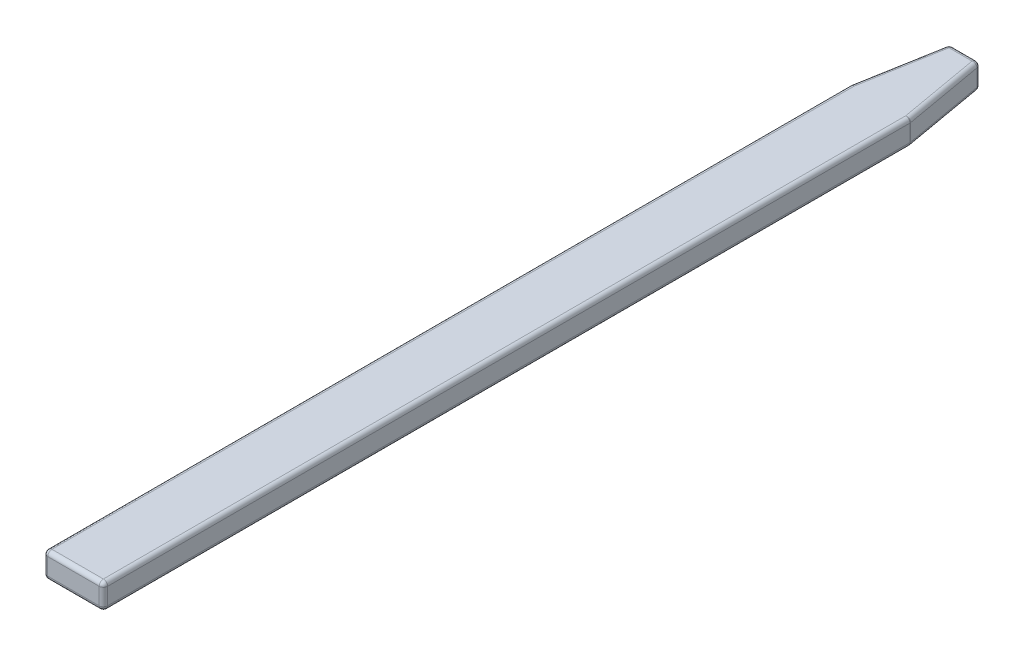
ISO-10303-21;
HEADER;
FILE_DESCRIPTION(('STEP AP214'),'2;1');
FILE_NAME('part.step','',(''),(''),'','','');
FILE_SCHEMA(('AUTOMOTIVE_DESIGN { 1 0 10303 214 1 1 1 1 }'));
ENDSEC;
DATA;
#1=APPLICATION_CONTEXT('core data for automotive mechanical design processes');
#2=APPLICATION_PROTOCOL_DEFINITION('international standard','automotive_design',2000,#1);
#3=PRODUCT_CONTEXT('',#1,'mechanical');
#4=PRODUCT('Part','Part','',(#3));
#5=PRODUCT_RELATED_PRODUCT_CATEGORY('part','',(#4));
#6=PRODUCT_DEFINITION_FORMATION('','',#4);
#7=PRODUCT_DEFINITION_CONTEXT('part definition',#1,'design');
#8=PRODUCT_DEFINITION('design','',#6,#7);
#9=PRODUCT_DEFINITION_SHAPE('','',#8);
#10=(LENGTH_UNIT() NAMED_UNIT(*) SI_UNIT(.MILLI.,.METRE.));
#11=(NAMED_UNIT(*) PLANE_ANGLE_UNIT() SI_UNIT($,.RADIAN.));
#12=(NAMED_UNIT(*) SI_UNIT($,.STERADIAN.) SOLID_ANGLE_UNIT());
#13=UNCERTAINTY_MEASURE_WITH_UNIT(LENGTH_MEASURE(1.E-05),#10,'distance_accuracy_value','');
#14=(GEOMETRIC_REPRESENTATION_CONTEXT(3) GLOBAL_UNCERTAINTY_ASSIGNED_CONTEXT((#13)) GLOBAL_UNIT_ASSIGNED_CONTEXT((#10,
#11,#12)) REPRESENTATION_CONTEXT('',''));
#15=CARTESIAN_POINT('',(0.,0.,0.));
#16=DIRECTION('',(0.,0.,1.));
#17=DIRECTION('',(1.,0.,0.));
#18=AXIS2_PLACEMENT_3D('',#15,#16,#17);
#19=CARTESIAN_POINT('',(-4.36328196226733,0.0999469366672908,-3.464));
#20=DIRECTION('',(0.351334189452752,-0.837407564963002,-0.418703782481497));
#21=DIRECTION('',(0.538275207015992,0.546578969722341,-0.641491411765704));
#22=AXIS2_PLACEMENT_3D('',#19,#20,#21);
#23=SPHERICAL_SURFACE('',#22,0.05);
#24=CARTESIAN_POINT('',(-4.36328196226733,0.0999469366672908,-3.464));
#25=DIRECTION('',(0.,1.,0.));
#26=DIRECTION('',(0.,0.,-1.));
#27=AXIS2_PLACEMENT_3D('',#24,#25,#26);
#28=CIRCLE('',#27,0.05);
#29=CARTESIAN_POINT('',(-4.31404157461672,0.0999469366672908,-3.47268240888335));
#30=VERTEX_POINT('',#29);
#31=CARTESIAN_POINT('',(-4.36328196226733,0.0999469366672908,-3.514));
#32=VERTEX_POINT('',#31);
#33=EDGE_CURVE('E11',#30,#32,#28,.T.);
#34=ORIENTED_EDGE('',*,*,#33,.T.);
#35=CARTESIAN_POINT('',(-4.36328196226733,0.0999469366672908,-3.464));
#36=DIRECTION('',(1.,0.,0.));
#37=DIRECTION('',(0.,1.,0.));
#38=AXIS2_PLACEMENT_3D('',#35,#36,#37);
#39=CIRCLE('',#38,0.05);
#40=CARTESIAN_POINT('',(-4.36328196226733,0.149946936667291,-3.464));
#41=VERTEX_POINT('',#40);
#42=EDGE_CURVE('E24',#32,#41,#39,.T.);
#43=ORIENTED_EDGE('',*,*,#42,.T.);
#44=CARTESIAN_POINT('',(-4.36328196226733,0.0999469366672908,-3.464));
#45=DIRECTION('',(-0.17364817766693,0.,-0.984807753012208));
#46=DIRECTION('',(0.984807753012208,0.,-0.17364817766693));
#47=AXIS2_PLACEMENT_3D('',#44,#45,#46);
#48=CIRCLE('',#47,0.0499999999999999);
#49=EDGE_CURVE('E280',#41,#30,#48,.T.);
#50=ORIENTED_EDGE('',*,*,#49,.T.);
#51=EDGE_LOOP('',(#34,#43,#50));
#52=FACE_BOUND('',#51,.T.);
#53=ADVANCED_FACE('F17',(#52),#23,.T.);
#54=CARTESIAN_POINT('',(-4.63671803773267,0.0999469366672909,-3.464));
#55=DIRECTION('',(-0.351334189452755,-0.837407564962995,-0.41870378248151));
#56=DIRECTION('',(-0.538275207015981,0.546578969722352,-0.641491411765703));
#57=AXIS2_PLACEMENT_3D('',#54,#55,#56);
#58=SPHERICAL_SURFACE('',#57,0.0499999999999994);
#59=CARTESIAN_POINT('',(-4.63671803773267,0.0999469366672909,-3.464));
#60=DIRECTION('',(-1.,0.,0.));
#61=DIRECTION('',(0.,0.,-1.));
#62=AXIS2_PLACEMENT_3D('',#59,#60,#61);
#63=CIRCLE('',#62,0.05);
#64=CARTESIAN_POINT('',(-4.63671803773267,0.149946936667291,-3.464));
#65=VERTEX_POINT('',#64);
#66=CARTESIAN_POINT('',(-4.63671803773267,0.0999469366672909,-3.514));
#67=VERTEX_POINT('',#66);
#68=EDGE_CURVE('E278',#65,#67,#63,.T.);
#69=ORIENTED_EDGE('',*,*,#68,.T.);
#70=CARTESIAN_POINT('',(-4.63671803773267,0.0999469366672909,-3.464));
#71=DIRECTION('',(0.,1.,0.));
#72=DIRECTION('',(-0.984807753012208,0.,-0.173648177666932));
#73=AXIS2_PLACEMENT_3D('',#70,#71,#72);
#74=CIRCLE('',#73,0.0499999999999994);
#75=CARTESIAN_POINT('',(-4.68595842538328,0.0999469366672909,-3.47268240888335));
#76=VERTEX_POINT('',#75);
#77=EDGE_CURVE('E276',#67,#76,#74,.T.);
#78=ORIENTED_EDGE('',*,*,#77,.T.);
#79=CARTESIAN_POINT('',(-4.63671803773267,0.0999469366672909,-3.464));
#80=DIRECTION('',(0.173648177666917,0.,-0.98480775301221));
#81=DIRECTION('',(0.,1.,0.));
#82=AXIS2_PLACEMENT_3D('',#79,#80,#81);
#83=CIRCLE('',#82,0.05);
#84=EDGE_CURVE('E273',#76,#65,#83,.T.);
#85=ORIENTED_EDGE('',*,*,#84,.T.);
#86=EDGE_LOOP('',(#69,#78,#85));
#87=FACE_BOUND('',#86,.T.);
#88=ADVANCED_FACE('F435',(#87),#58,.T.);
#89=CARTESIAN_POINT('',(-4.36328196226733,-0.100053063332709,-3.464));
#90=DIRECTION('',(-0.35133418945275,-0.837407564963,0.418703782481504));
#91=DIRECTION('',(0.538275207015991,-0.546578969722344,-0.641491411765702));
#92=AXIS2_PLACEMENT_3D('',#89,#90,#91);
#93=SPHERICAL_SURFACE('',#92,0.05);
#94=CARTESIAN_POINT('',(-4.36328196226733,-0.100053063332709,-3.464));
#95=DIRECTION('',(0.,-1.,0.));
#96=DIRECTION('',(0.984807753012208,0.,-0.17364817766693));
#97=AXIS2_PLACEMENT_3D('',#94,#95,#96);
#98=CIRCLE('',#97,0.0499999999999999);
#99=CARTESIAN_POINT('',(-4.36328196226733,-0.100053063332709,-3.514));
#100=VERTEX_POINT('',#99);
#101=CARTESIAN_POINT('',(-4.31404157461672,-0.100053063332709,-3.47268240888335));
#102=VERTEX_POINT('',#101);
#103=EDGE_CURVE('E271',#100,#102,#98,.T.);
#104=ORIENTED_EDGE('',*,*,#103,.T.);
#105=CARTESIAN_POINT('',(-4.36328196226733,-0.100053063332709,-3.464));
#106=DIRECTION('',(-0.173648177666943,0.,-0.984807753012206));
#107=DIRECTION('',(0.,-1.,0.));
#108=AXIS2_PLACEMENT_3D('',#105,#106,#107);
#109=CIRCLE('',#108,0.05);
#110=CARTESIAN_POINT('',(-4.36328196226733,-0.150053063332709,-3.464));
#111=VERTEX_POINT('',#110);
#112=EDGE_CURVE('E269',#102,#111,#109,.T.);
#113=ORIENTED_EDGE('',*,*,#112,.T.);
#114=CARTESIAN_POINT('',(-4.36328196226733,-0.100053063332709,-3.464));
#115=DIRECTION('',(1.,0.,0.));
#116=DIRECTION('',(0.,0.,-1.));
#117=AXIS2_PLACEMENT_3D('',#114,#115,#116);
#118=CIRCLE('',#117,0.05);
#119=EDGE_CURVE('E266',#111,#100,#118,.T.);
#120=ORIENTED_EDGE('',*,*,#119,.T.);
#121=EDGE_LOOP('',(#104,#113,#120));
#122=FACE_BOUND('',#121,.T.);
#123=ADVANCED_FACE('F432',(#122),#93,.T.);
#124=CARTESIAN_POINT('',(-4.195,0.0999469366672908,-2.50962556682371));
#125=DIRECTION('',(0.,0.,1.));
#126=DIRECTION('',(1.,0.,0.));
#127=AXIS2_PLACEMENT_3D('',#124,#125,#126);
#128=SPHERICAL_SURFACE('',#127,0.0499999999999999);
#129=CARTESIAN_POINT('',(-4.195,0.0999469366672908,-2.5096255668237));
#130=DIRECTION('',(0.,0.,-1.));
#131=DIRECTION('',(1.,0.,0.));
#132=AXIS2_PLACEMENT_3D('',#129,#130,#131);
#133=CIRCLE('',#132,0.05);
#134=CARTESIAN_POINT('',(-4.195,0.149946936667291,-2.50962556682371));
#135=VERTEX_POINT('',#134);
#136=CARTESIAN_POINT('',(-4.145,0.0999469366672909,-2.50962556682371));
#137=VERTEX_POINT('',#136);
#138=EDGE_CURVE('E264',#135,#137,#133,.T.);
#139=ORIENTED_EDGE('',*,*,#138,.T.);
#140=CARTESIAN_POINT('',(-4.195,0.0999469366672908,-2.50962556682371));
#141=DIRECTION('',(0.,1.,0.));
#142=DIRECTION('',(0.984807753012208,0.,-0.17364817766693));
#143=AXIS2_PLACEMENT_3D('',#140,#141,#142);
#144=CIRCLE('',#143,0.0499999999999999);
#145=CARTESIAN_POINT('',(-4.14575961234939,0.0999469366672908,-2.51830797570705));
#146=VERTEX_POINT('',#145);
#147=EDGE_CURVE('E262',#137,#146,#144,.T.);
#148=ORIENTED_EDGE('',*,*,#147,.T.);
#149=CARTESIAN_POINT('',(-4.195,0.0999469366672908,-2.50962556682371));
#150=DIRECTION('',(0.173648177666908,0.,0.984807753012212));
#151=DIRECTION('',(0.,1.,0.));
#152=AXIS2_PLACEMENT_3D('',#149,#150,#151);
#153=CIRCLE('',#152,0.05);
#154=EDGE_CURVE('E259',#146,#135,#153,.T.);
#155=ORIENTED_EDGE('',*,*,#154,.T.);
#156=EDGE_LOOP('',(#139,#148,#155));
#157=FACE_BOUND('',#156,.T.);
#158=ADVANCED_FACE('F434',(#157),#128,.T.);
#159=CARTESIAN_POINT('',(-4.63671803773267,-0.100053063332709,-3.464));
#160=DIRECTION('',(0.351334189452751,-0.837407564963003,0.418703782481496));
#161=DIRECTION('',(-0.538275207015993,-0.546578969722339,-0.641491411765704));
#162=AXIS2_PLACEMENT_3D('',#159,#160,#161);
#163=SPHERICAL_SURFACE('',#162,0.05);
#164=CARTESIAN_POINT('',(-4.63671803773267,-0.100053063332709,-3.464));
#165=DIRECTION('',(0.,-1.,0.));
#166=DIRECTION('',(0.,0.,-1.));
#167=AXIS2_PLACEMENT_3D('',#164,#165,#166);
#168=CIRCLE('',#167,0.05);
#169=CARTESIAN_POINT('',(-4.68595842538328,-0.100053063332709,-3.47268240888335));
#170=VERTEX_POINT('',#169);
#171=CARTESIAN_POINT('',(-4.63671803773267,-0.100053063332709,-3.514));
#172=VERTEX_POINT('',#171);
#173=EDGE_CURVE('E257',#170,#172,#168,.T.);
#174=ORIENTED_EDGE('',*,*,#173,.T.);
#175=CARTESIAN_POINT('',(-4.63671803773267,-0.100053063332709,-3.464));
#176=DIRECTION('',(-1.,0.,0.));
#177=DIRECTION('',(0.,-1.,0.));
#178=AXIS2_PLACEMENT_3D('',#175,#176,#177);
#179=CIRCLE('',#178,0.05);
#180=CARTESIAN_POINT('',(-4.63671803773267,-0.150053063332709,-3.464));
#181=VERTEX_POINT('',#180);
#182=EDGE_CURVE('E255',#172,#181,#179,.T.);
#183=ORIENTED_EDGE('',*,*,#182,.T.);
#184=CARTESIAN_POINT('',(-4.63671803773267,-0.100053063332709,-3.464));
#185=DIRECTION('',(0.173648177666928,0.,-0.984807753012208));
#186=DIRECTION('',(-0.984807753012208,0.,-0.173648177666928));
#187=AXIS2_PLACEMENT_3D('',#184,#185,#186);
#188=CIRCLE('',#187,0.0500000000000005);
#189=EDGE_CURVE('E252',#181,#170,#188,.T.);
#190=ORIENTED_EDGE('',*,*,#189,.T.);
#191=EDGE_LOOP('',(#174,#183,#190));
#192=FACE_BOUND('',#191,.T.);
#193=ADVANCED_FACE('F423',(#192),#163,.T.);
#194=CARTESIAN_POINT('',(-3.5525,-0.100053063332709,-3.464));
#195=DIRECTION('',(1.,0.,0.));
#196=DIRECTION('',(0.,-0.707106781186547,-0.707106781186548));
#197=AXIS2_PLACEMENT_3D('',#194,#195,#196);
#198=CYLINDRICAL_SURFACE('',#197,0.05);
#199=ORIENTED_EDGE('',*,*,#119,.F.);
#200=DIRECTION('',(-1.,0.,0.));
#201=VECTOR('',#200,1.);
#202=CARTESIAN_POINT('',(-3.5525,-0.150053063332709,-3.464));
#203=LINE('',#202,#201);
#204=EDGE_CURVE('E249',#111,#181,#203,.T.);
#205=ORIENTED_EDGE('',*,*,#204,.T.);
#206=ORIENTED_EDGE('',*,*,#182,.F.);
#207=DIRECTION('',(1.,0.,0.));
#208=VECTOR('',#207,1.);
#209=CARTESIAN_POINT('',(-3.5525,-0.100053063332709,-3.514));
#210=LINE('',#209,#208);
#211=EDGE_CURVE('E246',#172,#100,#210,.T.);
#212=ORIENTED_EDGE('',*,*,#211,.T.);
#213=EDGE_LOOP('',(#199,#205,#206,#212));
#214=FACE_BOUND('',#213,.T.);
#215=ADVANCED_FACE('F425',(#214),#198,.T.);
#216=CARTESIAN_POINT('',(-4.805,0.0999469366672909,-2.5096255668237));
#217=DIRECTION('',(0.,0.,1.));
#218=DIRECTION('',(1.,0.,0.));
#219=AXIS2_PLACEMENT_3D('',#216,#217,#218);
#220=SPHERICAL_SURFACE('',#219,0.05);
#221=CARTESIAN_POINT('',(-4.805,0.0999469366672909,-2.50962556682371));
#222=DIRECTION('',(0.,1.,0.));
#223=DIRECTION('',(-1.,0.,0.));
#224=AXIS2_PLACEMENT_3D('',#221,#222,#223);
#225=CIRCLE('',#224,0.05);
#226=CARTESIAN_POINT('',(-4.85424038765061,0.0999469366672909,-2.51830797570705));
#227=VERTEX_POINT('',#226);
#228=CARTESIAN_POINT('',(-4.855,0.099946936667291,-2.50962556682371));
#229=VERTEX_POINT('',#228);
#230=EDGE_CURVE('E244',#227,#229,#225,.T.);
#231=ORIENTED_EDGE('',*,*,#230,.T.);
#232=CARTESIAN_POINT('',(-4.805,0.0999469366672909,-2.5096255668237));
#233=DIRECTION('',(0.,0.,-1.));
#234=DIRECTION('',(0.,1.,0.));
#235=AXIS2_PLACEMENT_3D('',#232,#233,#234);
#236=CIRCLE('',#235,0.05);
#237=CARTESIAN_POINT('',(-4.805,0.149946936667291,-2.5096255668237));
#238=VERTEX_POINT('',#237);
#239=EDGE_CURVE('E242',#229,#238,#236,.T.);
#240=ORIENTED_EDGE('',*,*,#239,.T.);
#241=CARTESIAN_POINT('',(-4.805,0.0999469366672909,-2.5096255668237));
#242=DIRECTION('',(-0.173648177666939,0.,0.984807753012207));
#243=DIRECTION('',(-0.984807753012207,0.,-0.173648177666939));
#244=AXIS2_PLACEMENT_3D('',#241,#242,#243);
#245=CIRCLE('',#244,0.0500000000000006);
#246=EDGE_CURVE('E239',#238,#227,#245,.T.);
#247=ORIENTED_EDGE('',*,*,#246,.T.);
#248=EDGE_LOOP('',(#231,#240,#247));
#249=FACE_BOUND('',#248,.T.);
#250=ADVANCED_FACE('F415',(#249),#220,.T.);
#251=CARTESIAN_POINT('',(-4.195,-0.100053063332709,-2.5096255668237));
#252=DIRECTION('',(0.,0.,1.));
#253=DIRECTION('',(1.,0.,0.));
#254=AXIS2_PLACEMENT_3D('',#251,#252,#253);
#255=SPHERICAL_SURFACE('',#254,0.05);
#256=CARTESIAN_POINT('',(-4.195,-0.100053063332709,-2.5096255668237));
#257=DIRECTION('',(0.,-1.,0.));
#258=DIRECTION('',(1.,0.,0.));
#259=AXIS2_PLACEMENT_3D('',#256,#257,#258);
#260=CIRCLE('',#259,0.05);
#261=CARTESIAN_POINT('',(-4.14575961234939,-0.100053063332709,-2.51830797570705));
#262=VERTEX_POINT('',#261);
#263=CARTESIAN_POINT('',(-4.145,-0.100053063332709,-2.5096255668237));
#264=VERTEX_POINT('',#263);
#265=EDGE_CURVE('E237',#262,#264,#260,.T.);
#266=ORIENTED_EDGE('',*,*,#265,.T.);
#267=CARTESIAN_POINT('',(-4.195,-0.100053063332709,-2.5096255668237));
#268=DIRECTION('',(0.,0.,-1.));
#269=DIRECTION('',(0.,-1.,0.));
#270=AXIS2_PLACEMENT_3D('',#267,#268,#269);
#271=CIRCLE('',#270,0.05);
#272=CARTESIAN_POINT('',(-4.195,-0.150053063332709,-2.5096255668237));
#273=VERTEX_POINT('',#272);
#274=EDGE_CURVE('E235',#264,#273,#271,.T.);
#275=ORIENTED_EDGE('',*,*,#274,.T.);
#276=CARTESIAN_POINT('',(-4.195,-0.100053063332709,-2.5096255668237));
#277=DIRECTION('',(0.173648177666941,0.,0.984807753012206));
#278=DIRECTION('',(0.984807753012206,0.,-0.173648177666941));
#279=AXIS2_PLACEMENT_3D('',#276,#277,#278);
#280=CIRCLE('',#279,0.05);
#281=EDGE_CURVE('E232',#273,#262,#280,.T.);
#282=ORIENTED_EDGE('',*,*,#281,.T.);
#283=EDGE_LOOP('',(#266,#275,#282));
#284=FACE_BOUND('',#283,.T.);
#285=ADVANCED_FACE('F492',(#284),#255,.T.);
#286=CARTESIAN_POINT('',(-4.195,0.0999469366672908,7.006));
#287=DIRECTION('',(-0.816496580927725,0.408248290463866,0.408248290463862));
#288=DIRECTION('',(0.577350269189627,0.577350269189627,0.577350269189624));
#289=AXIS2_PLACEMENT_3D('',#286,#287,#288);
#290=SPHERICAL_SURFACE('',#289,0.05);
#291=CARTESIAN_POINT('',(-4.195,0.0999469366672908,7.006));
#292=DIRECTION('',(0.,1.,0.));
#293=DIRECTION('',(1.,0.,0.));
#294=AXIS2_PLACEMENT_3D('',#291,#292,#293);
#295=CIRCLE('',#294,0.05);
#296=CARTESIAN_POINT('',(-4.195,0.0999469366672908,7.056));
#297=VERTEX_POINT('',#296);
#298=CARTESIAN_POINT('',(-4.145,0.0999469366672909,7.006));
#299=VERTEX_POINT('',#298);
#300=EDGE_CURVE('E230',#297,#299,#295,.T.);
#301=ORIENTED_EDGE('',*,*,#300,.T.);
#302=CARTESIAN_POINT('',(-4.195,0.0999469366672908,7.006));
#303=DIRECTION('',(0.,0.,1.));
#304=DIRECTION('',(0.,1.,0.));
#305=AXIS2_PLACEMENT_3D('',#302,#303,#304);
#306=CIRCLE('',#305,0.05);
#307=CARTESIAN_POINT('',(-4.195,0.149946936667291,7.006));
#308=VERTEX_POINT('',#307);
#309=EDGE_CURVE('E228',#299,#308,#306,.T.);
#310=ORIENTED_EDGE('',*,*,#309,.T.);
#311=CARTESIAN_POINT('',(-4.195,0.0999469366672908,7.006));
#312=DIRECTION('',(1.,0.,0.));
#313=DIRECTION('',(0.,0.,1.));
#314=AXIS2_PLACEMENT_3D('',#311,#312,#313);
#315=CIRCLE('',#314,0.05);
#316=EDGE_CURVE('E225',#308,#297,#315,.T.);
#317=ORIENTED_EDGE('',*,*,#316,.T.);
#318=EDGE_LOOP('',(#301,#310,#317));
#319=FACE_BOUND('',#318,.T.);
#320=ADVANCED_FACE('F501',(#319),#290,.T.);
#321=CARTESIAN_POINT('',(-4.195,0.0999469366672908,7.006));
#322=DIRECTION('',(0.,0.,-1.));
#323=DIRECTION('',(0.707106781186547,0.707106781186548,0.));
#324=AXIS2_PLACEMENT_3D('',#321,#322,#323);
#325=CYLINDRICAL_SURFACE('',#324,0.05);
#326=ORIENTED_EDGE('',*,*,#138,.F.);
#327=DIRECTION('',(0.,0.,1.));
#328=VECTOR('',#327,1.);
#329=CARTESIAN_POINT('',(-4.195,0.149946936667291,7.006));
#330=LINE('',#329,#328);
#331=EDGE_CURVE('E222',#135,#308,#330,.T.);
#332=ORIENTED_EDGE('',*,*,#331,.T.);
#333=ORIENTED_EDGE('',*,*,#309,.F.);
#334=DIRECTION('',(0.,0.,-1.));
#335=VECTOR('',#334,1.);
#336=CARTESIAN_POINT('',(-4.145,0.0999469366672909,7.006));
#337=LINE('',#336,#335);
#338=EDGE_CURVE('E219',#299,#137,#337,.T.);
#339=ORIENTED_EDGE('',*,*,#338,.T.);
#340=EDGE_LOOP('',(#326,#332,#333,#339));
#341=FACE_BOUND('',#340,.T.);
#342=ADVANCED_FACE('F510',(#341),#325,.T.);
#343=CARTESIAN_POINT('',(-4.805,-0.100053063332709,-2.5096255668237));
#344=DIRECTION('',(0.,0.,1.));
#345=DIRECTION('',(1.,0.,0.));
#346=AXIS2_PLACEMENT_3D('',#343,#344,#345);
#347=SPHERICAL_SURFACE('',#346,0.0500000000000006);
#348=CARTESIAN_POINT('',(-4.805,-0.100053063332709,-2.50962556682371));
#349=DIRECTION('',(-0.173648177666883,0.,0.984807753012216));
#350=DIRECTION('',(0.,-1.,0.));
#351=AXIS2_PLACEMENT_3D('',#348,#349,#350);
#352=CIRCLE('',#351,0.05);
#353=CARTESIAN_POINT('',(-4.85424038765061,-0.100053063332709,-2.51830797570705));
#354=VERTEX_POINT('',#353);
#355=CARTESIAN_POINT('',(-4.805,-0.150053063332709,-2.50962556682371));
#356=VERTEX_POINT('',#355);
#357=EDGE_CURVE('E217',#354,#356,#352,.T.);
#358=ORIENTED_EDGE('',*,*,#357,.T.);
#359=CARTESIAN_POINT('',(-4.805,-0.100053063332709,-2.5096255668237));
#360=DIRECTION('',(0.,0.,-1.));
#361=DIRECTION('',(-1.,0.,0.));
#362=AXIS2_PLACEMENT_3D('',#359,#360,#361);
#363=CIRCLE('',#362,0.0500000000000006);
#364=CARTESIAN_POINT('',(-4.855,-0.100053063332709,-2.5096255668237));
#365=VERTEX_POINT('',#364);
#366=EDGE_CURVE('E163',#356,#365,#363,.T.);
#367=ORIENTED_EDGE('',*,*,#366,.T.);
#368=CARTESIAN_POINT('',(-4.805,-0.100053063332709,-2.5096255668237));
#369=DIRECTION('',(0.,-1.,0.));
#370=DIRECTION('',(-0.984807753012208,0.,-0.17364817766693));
#371=AXIS2_PLACEMENT_3D('',#368,#369,#370);
#372=CIRCLE('',#371,0.0499999999999999);
#373=EDGE_CURVE('E213',#365,#354,#372,.T.);
#374=ORIENTED_EDGE('',*,*,#373,.T.);
#375=EDGE_LOOP('',(#358,#367,#374));
#376=FACE_BOUND('',#375,.T.);
#377=ADVANCED_FACE('F369',(#376),#347,.T.);
#378=CARTESIAN_POINT('',(-4.805,0.0999469366672909,7.006));
#379=DIRECTION('',(-0.816496580927725,-0.408248290463866,-0.408248290463862));
#380=DIRECTION('',(-0.577350269189627,0.577350269189628,0.577350269189623));
#381=AXIS2_PLACEMENT_3D('',#378,#379,#380);
#382=SPHERICAL_SURFACE('',#381,0.05);
#383=CARTESIAN_POINT('',(-4.805,0.0999469366672909,7.006));
#384=DIRECTION('',(-1.,0.,0.));
#385=DIRECTION('',(0.,1.,0.));
#386=AXIS2_PLACEMENT_3D('',#383,#384,#385);
#387=CIRCLE('',#386,0.05);
#388=CARTESIAN_POINT('',(-4.805,0.0999469366672909,7.056));
#389=VERTEX_POINT('',#388);
#390=CARTESIAN_POINT('',(-4.805,0.149946936667291,7.006));
#391=VERTEX_POINT('',#390);
#392=EDGE_CURVE('E211',#389,#391,#387,.T.);
#393=ORIENTED_EDGE('',*,*,#392,.T.);
#394=CARTESIAN_POINT('',(-4.805,0.0999469366672909,7.006));
#395=DIRECTION('',(0.,0.,1.));
#396=DIRECTION('',(-1.,0.,0.));
#397=AXIS2_PLACEMENT_3D('',#394,#395,#396);
#398=CIRCLE('',#397,0.05);
#399=CARTESIAN_POINT('',(-4.855,0.099946936667291,7.006));
#400=VERTEX_POINT('',#399);
#401=EDGE_CURVE('E209',#391,#400,#398,.T.);
#402=ORIENTED_EDGE('',*,*,#401,.T.);
#403=CARTESIAN_POINT('',(-4.805,0.0999469366672909,7.006));
#404=DIRECTION('',(0.,1.,0.));
#405=DIRECTION('',(0.,0.,1.));
#406=AXIS2_PLACEMENT_3D('',#403,#404,#405);
#407=CIRCLE('',#406,0.05);
#408=EDGE_CURVE('E206',#400,#389,#407,.T.);
#409=ORIENTED_EDGE('',*,*,#408,.T.);
#410=EDGE_LOOP('',(#393,#402,#409));
#411=FACE_BOUND('',#410,.T.);
#412=ADVANCED_FACE('F405',(#411),#382,.T.);
#413=CARTESIAN_POINT('',(-4.805,0.0999469366672909,7.006));
#414=DIRECTION('',(0.,0.,1.));
#415=DIRECTION('',(-0.707106781186547,0.707106781186548,0.));
#416=AXIS2_PLACEMENT_3D('',#413,#414,#415);
#417=CYLINDRICAL_SURFACE('',#416,0.05);
#418=ORIENTED_EDGE('',*,*,#401,.F.);
#419=DIRECTION('',(0.,0.,-1.));
#420=VECTOR('',#419,1.);
#421=CARTESIAN_POINT('',(-4.805,0.149946936667291,7.006));
#422=LINE('',#421,#420);
#423=EDGE_CURVE('E203',#391,#238,#422,.T.);
#424=ORIENTED_EDGE('',*,*,#423,.T.);
#425=ORIENTED_EDGE('',*,*,#239,.F.);
#426=DIRECTION('',(0.,0.,1.));
#427=VECTOR('',#426,1.);
#428=CARTESIAN_POINT('',(-4.855,0.099946936667291,7.006));
#429=LINE('',#428,#427);
#430=EDGE_CURVE('E200',#229,#400,#429,.T.);
#431=ORIENTED_EDGE('',*,*,#430,.T.);
#432=EDGE_LOOP('',(#418,#424,#425,#431));
#433=FACE_BOUND('',#432,.T.);
#434=ADVANCED_FACE('F407',(#433),#417,.T.);
#435=CARTESIAN_POINT('',(-4.195,-0.100053063332709,7.006));
#436=DIRECTION('',(-0.40824829046386,-0.816496580927729,-0.40824829046386));
#437=DIRECTION('',(0.577350269189628,-0.577350269189622,0.577350269189628));
#438=AXIS2_PLACEMENT_3D('',#435,#436,#437);
#439=SPHERICAL_SURFACE('',#438,0.05);
#440=CARTESIAN_POINT('',(-4.195,-0.100053063332709,7.006));
#441=DIRECTION('',(1.,0.,0.));
#442=DIRECTION('',(0.,-1.,0.));
#443=AXIS2_PLACEMENT_3D('',#440,#441,#442);
#444=CIRCLE('',#443,0.05);
#445=CARTESIAN_POINT('',(-4.195,-0.100053063332709,7.056));
#446=VERTEX_POINT('',#445);
#447=CARTESIAN_POINT('',(-4.195,-0.150053063332709,7.006));
#448=VERTEX_POINT('',#447);
#449=EDGE_CURVE('E198',#446,#448,#444,.T.);
#450=ORIENTED_EDGE('',*,*,#449,.T.);
#451=CARTESIAN_POINT('',(-4.195,-0.100053063332709,7.006));
#452=DIRECTION('',(0.,0.,1.));
#453=DIRECTION('',(1.,0.,0.));
#454=AXIS2_PLACEMENT_3D('',#451,#452,#453);
#455=CIRCLE('',#454,0.05);
#456=CARTESIAN_POINT('',(-4.145,-0.100053063332709,7.006));
#457=VERTEX_POINT('',#456);
#458=EDGE_CURVE('E196',#448,#457,#455,.T.);
#459=ORIENTED_EDGE('',*,*,#458,.T.);
#460=CARTESIAN_POINT('',(-4.195,-0.100053063332709,7.006));
#461=DIRECTION('',(0.,-1.,0.));
#462=DIRECTION('',(0.,0.,1.));
#463=AXIS2_PLACEMENT_3D('',#460,#461,#462);
#464=CIRCLE('',#463,0.05);
#465=EDGE_CURVE('E193',#457,#446,#464,.T.);
#466=ORIENTED_EDGE('',*,*,#465,.T.);
#467=EDGE_LOOP('',(#450,#459,#466));
#468=FACE_BOUND('',#467,.T.);
#469=ADVANCED_FACE('F393',(#468),#439,.T.);
#470=CARTESIAN_POINT('',(-4.195,-0.100053063332709,7.006));
#471=DIRECTION('',(0.,0.,1.));
#472=DIRECTION('',(0.707106781186548,-0.707106781186547,0.));
#473=AXIS2_PLACEMENT_3D('',#470,#471,#472);
#474=CYLINDRICAL_SURFACE('',#473,0.05);
#475=ORIENTED_EDGE('',*,*,#458,.F.);
#476=DIRECTION('',(0.,0.,-1.));
#477=VECTOR('',#476,1.);
#478=CARTESIAN_POINT('',(-4.195,-0.150053063332709,7.006));
#479=LINE('',#478,#477);
#480=EDGE_CURVE('E172',#448,#273,#479,.T.);
#481=ORIENTED_EDGE('',*,*,#480,.T.);
#482=ORIENTED_EDGE('',*,*,#274,.F.);
#483=DIRECTION('',(0.,0.,1.));
#484=VECTOR('',#483,1.);
#485=CARTESIAN_POINT('',(-4.145,-0.100053063332709,7.006));
#486=LINE('',#485,#484);
#487=EDGE_CURVE('E189',#264,#457,#486,.T.);
#488=ORIENTED_EDGE('',*,*,#487,.T.);
#489=EDGE_LOOP('',(#475,#481,#482,#488));
#490=FACE_BOUND('',#489,.T.);
#491=ADVANCED_FACE('F388',(#490),#474,.T.);
#492=CARTESIAN_POINT('',(-4.195,-0.0750530633327088,7.006));
#493=DIRECTION('',(0.,1.,0.));
#494=DIRECTION('',(0.70710678118654,0.,0.707106781186555));
#495=AXIS2_PLACEMENT_3D('',#492,#493,#494);
#496=CYLINDRICAL_SURFACE('',#495,0.05);
#497=ORIENTED_EDGE('',*,*,#300,.F.);
#498=DIRECTION('',(0.,-1.,0.));
#499=VECTOR('',#498,1.);
#500=CARTESIAN_POINT('',(-4.195,-0.0750530633327088,7.056));
#501=LINE('',#500,#499);
#502=EDGE_CURVE('E186',#297,#446,#501,.T.);
#503=ORIENTED_EDGE('',*,*,#502,.T.);
#504=ORIENTED_EDGE('',*,*,#465,.F.);
#505=DIRECTION('',(0.,1.,0.));
#506=VECTOR('',#505,1.);
#507=CARTESIAN_POINT('',(-4.145,-0.0750530633327087,7.006));
#508=LINE('',#507,#506);
#509=EDGE_CURVE('E183',#457,#299,#508,.T.);
#510=ORIENTED_EDGE('',*,*,#509,.T.);
#511=EDGE_LOOP('',(#497,#503,#504,#510));
#512=FACE_BOUND('',#511,.T.);
#513=ADVANCED_FACE('F395',(#512),#496,.T.);
#514=CARTESIAN_POINT('',(-4.805,-0.100053063332709,7.006));
#515=DIRECTION('',(-0.408248290463858,-0.408248290463854,-0.816496580927733));
#516=DIRECTION('',(-0.57735026918964,-0.577350269189621,0.577350269189616));
#517=AXIS2_PLACEMENT_3D('',#514,#515,#516);
#518=SPHERICAL_SURFACE('',#517,0.05);
#519=CARTESIAN_POINT('',(-4.805,-0.100053063332709,7.006));
#520=DIRECTION('',(0.,-1.,0.));
#521=DIRECTION('',(-1.,0.,0.));
#522=AXIS2_PLACEMENT_3D('',#519,#520,#521);
#523=CIRCLE('',#522,0.05);
#524=CARTESIAN_POINT('',(-4.805,-0.100053063332709,7.056));
#525=VERTEX_POINT('',#524);
#526=CARTESIAN_POINT('',(-4.855,-0.100053063332709,7.006));
#527=VERTEX_POINT('',#526);
#528=EDGE_CURVE('E143',#525,#527,#523,.T.);
#529=ORIENTED_EDGE('',*,*,#528,.T.);
#530=CARTESIAN_POINT('',(-4.805,-0.100053063332709,7.006));
#531=DIRECTION('',(0.,0.,1.));
#532=DIRECTION('',(0.,-1.,0.));
#533=AXIS2_PLACEMENT_3D('',#530,#531,#532);
#534=CIRCLE('',#533,0.05);
#535=CARTESIAN_POINT('',(-4.805,-0.150053063332709,7.006));
#536=VERTEX_POINT('',#535);
#537=EDGE_CURVE('E138',#527,#536,#534,.T.);
#538=ORIENTED_EDGE('',*,*,#537,.T.);
#539=CARTESIAN_POINT('',(-4.805,-0.100053063332709,7.006));
#540=DIRECTION('',(-1.,0.,0.));
#541=DIRECTION('',(0.,0.,1.));
#542=AXIS2_PLACEMENT_3D('',#539,#540,#541);
#543=CIRCLE('',#542,0.05);
#544=EDGE_CURVE('E141',#536,#525,#543,.T.);
#545=ORIENTED_EDGE('',*,*,#544,.T.);
#546=EDGE_LOOP('',(#529,#538,#545));
#547=FACE_BOUND('',#546,.T.);
#548=ADVANCED_FACE('F140',(#547),#518,.T.);
#549=CARTESIAN_POINT('',(-4.805,-0.100053063332709,7.006));
#550=DIRECTION('',(0.,0.,1.));
#551=DIRECTION('',(-0.707106781186548,-0.707106781186547,0.));
#552=AXIS2_PLACEMENT_3D('',#549,#550,#551);
#553=CYLINDRICAL_SURFACE('',#552,0.05);
#554=ORIENTED_EDGE('',*,*,#537,.F.);
#555=DIRECTION('',(0.,0.,-1.));
#556=VECTOR('',#555,1.);
#557=CARTESIAN_POINT('',(-4.855,-0.100053063332709,7.006));
#558=LINE('',#557,#556);
#559=EDGE_CURVE('E157',#527,#365,#558,.T.);
#560=ORIENTED_EDGE('',*,*,#559,.T.);
#561=ORIENTED_EDGE('',*,*,#366,.F.);
#562=DIRECTION('',(0.,0.,1.));
#563=VECTOR('',#562,1.);
#564=CARTESIAN_POINT('',(-4.805,-0.150053063332709,7.006));
#565=LINE('',#564,#563);
#566=EDGE_CURVE('E161',#356,#536,#565,.T.);
#567=ORIENTED_EDGE('',*,*,#566,.T.);
#568=EDGE_LOOP('',(#554,#560,#561,#567));
#569=FACE_BOUND('',#568,.T.);
#570=ADVANCED_FACE('F162',(#569),#553,.T.);
#571=CARTESIAN_POINT('',(-4.6775,-0.100053063332709,7.006));
#572=DIRECTION('',(1.,0.,0.));
#573=DIRECTION('',(0.,-0.707106781186539,0.707106781186556));
#574=AXIS2_PLACEMENT_3D('',#571,#572,#573);
#575=CYLINDRICAL_SURFACE('',#574,0.05);
#576=ORIENTED_EDGE('',*,*,#449,.F.);
#577=DIRECTION('',(-1.,0.,0.));
#578=VECTOR('',#577,1.);
#579=CARTESIAN_POINT('',(-4.6775,-0.100053063332709,7.056));
#580=LINE('',#579,#578);
#581=EDGE_CURVE('E155',#446,#525,#580,.T.);
#582=ORIENTED_EDGE('',*,*,#581,.T.);
#583=ORIENTED_EDGE('',*,*,#544,.F.);
#584=DIRECTION('',(1.,0.,0.));
#585=VECTOR('',#584,1.);
#586=CARTESIAN_POINT('',(-4.6775,-0.150053063332709,7.006));
#587=LINE('',#586,#585);
#588=EDGE_CURVE('E153',#536,#448,#587,.T.);
#589=ORIENTED_EDGE('',*,*,#588,.T.);
#590=EDGE_LOOP('',(#576,#582,#583,#589));
#591=FACE_BOUND('',#590,.T.);
#592=ADVANCED_FACE('F151',(#591),#575,.T.);
#593=CARTESIAN_POINT('',(-4.805,0.0749469366672912,7.006));
#594=DIRECTION('',(0.,-1.,0.));
#595=DIRECTION('',(-0.70710678118654,0.,0.707106781186555));
#596=AXIS2_PLACEMENT_3D('',#593,#594,#595);
#597=CYLINDRICAL_SURFACE('',#596,0.05);
#598=ORIENTED_EDGE('',*,*,#528,.F.);
#599=DIRECTION('',(0.,1.,0.));
#600=VECTOR('',#599,1.);
#601=CARTESIAN_POINT('',(-4.805,0.0749469366672912,7.056));
#602=LINE('',#601,#600);
#603=EDGE_CURVE('E173',#525,#389,#602,.T.);
#604=ORIENTED_EDGE('',*,*,#603,.T.);
#605=ORIENTED_EDGE('',*,*,#408,.F.);
#606=DIRECTION('',(0.,-1.,0.));
#607=VECTOR('',#606,1.);
#608=CARTESIAN_POINT('',(-4.855,0.0749469366672913,7.006));
#609=LINE('',#608,#607);
#610=EDGE_CURVE('E177',#400,#527,#609,.T.);
#611=ORIENTED_EDGE('',*,*,#610,.T.);
#612=EDGE_LOOP('',(#598,#604,#605,#611));
#613=FACE_BOUND('',#612,.T.);
#614=ADVANCED_FACE('F358',(#613),#597,.T.);
#615=CARTESIAN_POINT('',(-4.3225,0.0999469366672908,7.006));
#616=DIRECTION('',(-1.,0.,0.));
#617=DIRECTION('',(0.,0.707106781186539,0.707106781186556));
#618=AXIS2_PLACEMENT_3D('',#615,#616,#617);
#619=CYLINDRICAL_SURFACE('',#618,0.05);
#620=ORIENTED_EDGE('',*,*,#392,.F.);
#621=DIRECTION('',(1.,0.,0.));
#622=VECTOR('',#621,1.);
#623=CARTESIAN_POINT('',(-4.3225,0.0999469366672908,7.056));
#624=LINE('',#623,#622);
#625=EDGE_CURVE('E352',#389,#297,#624,.T.);
#626=ORIENTED_EDGE('',*,*,#625,.T.);
#627=ORIENTED_EDGE('',*,*,#316,.F.);
#628=DIRECTION('',(-1.,0.,0.));
#629=VECTOR('',#628,1.);
#630=CARTESIAN_POINT('',(-4.3225,0.149946936667291,7.006));
#631=LINE('',#630,#629);
#632=EDGE_CURVE('E349',#308,#391,#631,.T.);
#633=ORIENTED_EDGE('',*,*,#632,.T.);
#634=EDGE_LOOP('',(#620,#626,#627,#633));
#635=FACE_BOUND('',#634,.T.);
#636=ADVANCED_FACE('F402',(#635),#619,.T.);
#637=CARTESIAN_POINT('',(-4.805,-5.30633327590697E-05,-2.5096255668237));
#638=DIRECTION('',(0.,-1.,0.));
#639=DIRECTION('',(-0.996194698091745,0.,-0.0871557427476639));
#640=AXIS2_PLACEMENT_3D('',#637,#638,#639);
#641=CYLINDRICAL_SURFACE('',#640,0.05);
#642=ORIENTED_EDGE('',*,*,#373,.F.);
#643=DIRECTION('',(0.,1.,0.));
#644=VECTOR('',#643,1.);
#645=CARTESIAN_POINT('',(-4.855,-5.30633327589771E-05,-2.5096255668237));
#646=LINE('',#645,#644);
#647=EDGE_CURVE('E346',#365,#229,#646,.T.);
#648=ORIENTED_EDGE('',*,*,#647,.T.);
#649=ORIENTED_EDGE('',*,*,#230,.F.);
#650=DIRECTION('',(0.,-1.,0.));
#651=VECTOR('',#650,1.);
#652=CARTESIAN_POINT('',(-4.85424038765061,-5.30633327590697E-05,-2.51830797570705));
#653=LINE('',#652,#651);
#654=EDGE_CURVE('E343',#227,#354,#653,.T.);
#655=ORIENTED_EDGE('',*,*,#654,.T.);
#656=EDGE_LOOP('',(#642,#648,#649,#655));
#657=FACE_BOUND('',#656,.T.);
#658=ADVANCED_FACE('F365',(#657),#641,.T.);
#659=CARTESIAN_POINT('',(-5.61976755346448,-0.100053063332709,2.11115084635381));
#660=DIRECTION('',(0.17364817766693,0.,-0.984807753012208));
#661=DIRECTION('',(-0.696364240320023,-0.707106781186544,-0.122787803968973));
#662=AXIS2_PLACEMENT_3D('',#659,#660,#661);
#663=CYLINDRICAL_SURFACE('',#662,0.05);
#664=ORIENTED_EDGE('',*,*,#189,.F.);
#665=DIRECTION('',(-0.17364817766693,0.,0.984807753012208));
#666=VECTOR('',#665,1.);
#667=CARTESIAN_POINT('',(-5.61976755346448,-0.150053063332709,2.11115084635381));
#668=LINE('',#667,#666);
#669=EDGE_CURVE('E341',#181,#356,#668,.T.);
#670=ORIENTED_EDGE('',*,*,#669,.T.);
#671=ORIENTED_EDGE('',*,*,#357,.F.);
#672=DIRECTION('',(0.17364817766693,0.,-0.984807753012208));
#673=VECTOR('',#672,1.);
#674=CARTESIAN_POINT('',(-5.66900794111509,-0.100053063332709,2.10246843747046));
#675=LINE('',#674,#673);
#676=EDGE_CURVE('E338',#354,#170,#675,.T.);
#677=ORIENTED_EDGE('',*,*,#676,.T.);
#678=EDGE_LOOP('',(#664,#670,#671,#677));
#679=FACE_BOUND('',#678,.T.);
#680=ADVANCED_FACE('F372',(#679),#663,.T.);
#681=CARTESIAN_POINT('',(-3.47910049670026,-0.100053063332709,1.5504422709135));
#682=DIRECTION('',(0.17364817766693,0.,0.984807753012208));
#683=DIRECTION('',(0.696364240320023,-0.707106781186544,-0.122787803968973));
#684=AXIS2_PLACEMENT_3D('',#681,#682,#683);
#685=CYLINDRICAL_SURFACE('',#684,0.05);
#686=ORIENTED_EDGE('',*,*,#281,.F.);
#687=DIRECTION('',(-0.17364817766693,0.,-0.984807753012208));
#688=VECTOR('',#687,1.);
#689=CARTESIAN_POINT('',(-3.47910049670026,-0.150053063332709,1.5504422709135));
#690=LINE('',#689,#688);
#691=EDGE_CURVE('E335',#273,#111,#690,.T.);
#692=ORIENTED_EDGE('',*,*,#691,.T.);
#693=ORIENTED_EDGE('',*,*,#112,.F.);
#694=DIRECTION('',(0.17364817766693,0.,0.984807753012208));
#695=VECTOR('',#694,1.);
#696=CARTESIAN_POINT('',(-3.42986010904965,-0.100053063332709,1.54175986203016));
#697=LINE('',#696,#695);
#698=EDGE_CURVE('E332',#102,#262,#697,.T.);
#699=ORIENTED_EDGE('',*,*,#698,.T.);
#700=EDGE_LOOP('',(#686,#692,#693,#699));
#701=FACE_BOUND('',#700,.T.);
#702=ADVANCED_FACE('F381',(#701),#685,.T.);
#703=CARTESIAN_POINT('',(-4.195,-0.150053063332754,-2.5096255668237));
#704=DIRECTION('',(0.,1.,0.));
#705=DIRECTION('',(0.996194698091745,0.,-0.0871557427476629));
#706=AXIS2_PLACEMENT_3D('',#703,#704,#705);
#707=CYLINDRICAL_SURFACE('',#706,0.05);
#708=ORIENTED_EDGE('',*,*,#147,.F.);
#709=DIRECTION('',(0.,-1.,0.));
#710=VECTOR('',#709,1.);
#711=CARTESIAN_POINT('',(-4.145,-0.150053063332754,-2.5096255668237));
#712=LINE('',#711,#710);
#713=EDGE_CURVE('E329',#137,#264,#712,.T.);
#714=ORIENTED_EDGE('',*,*,#713,.T.);
#715=ORIENTED_EDGE('',*,*,#265,.F.);
#716=DIRECTION('',(0.,1.,0.));
#717=VECTOR('',#716,1.);
#718=CARTESIAN_POINT('',(-4.14575961234939,-0.150053063332754,-2.51830797570705));
#719=LINE('',#718,#717);
#720=EDGE_CURVE('E326',#262,#146,#719,.T.);
#721=ORIENTED_EDGE('',*,*,#720,.T.);
#722=EDGE_LOOP('',(#708,#714,#715,#721));
#723=FACE_BOUND('',#722,.T.);
#724=ADVANCED_FACE('F633',(#723),#707,.T.);
#725=CARTESIAN_POINT('',(-5.60906299365398,0.0999469366672911,2.0504422709135));
#726=DIRECTION('',(-0.17364817766693,0.,0.984807753012208));
#727=DIRECTION('',(-0.696364240320023,0.707106781186544,-0.122787803968973));
#728=AXIS2_PLACEMENT_3D('',#725,#726,#727);
#729=CYLINDRICAL_SURFACE('',#728,0.05);
#730=ORIENTED_EDGE('',*,*,#246,.F.);
#731=DIRECTION('',(0.17364817766693,0.,-0.984807753012208));
#732=VECTOR('',#731,1.);
#733=CARTESIAN_POINT('',(-5.60906299365398,0.149946936667291,2.0504422709135));
#734=LINE('',#733,#732);
#735=EDGE_CURVE('E323',#238,#65,#734,.T.);
#736=ORIENTED_EDGE('',*,*,#735,.T.);
#737=ORIENTED_EDGE('',*,*,#84,.F.);
#738=DIRECTION('',(-0.17364817766693,0.,0.984807753012208));
#739=VECTOR('',#738,1.);
#740=CARTESIAN_POINT('',(-5.65830338130459,0.0999469366672911,2.04175986203016));
#741=LINE('',#740,#739);
#742=EDGE_CURVE('E320',#76,#227,#741,.T.);
#743=ORIENTED_EDGE('',*,*,#742,.T.);
#744=EDGE_LOOP('',(#730,#736,#737,#743));
#745=FACE_BOUND('',#744,.T.);
#746=ADVANCED_FACE('F412',(#745),#729,.T.);
#747=CARTESIAN_POINT('',(-4.63671803773267,-0.075053063332709,-3.464));
#748=DIRECTION('',(0.,1.,0.));
#749=DIRECTION('',(-0.642787609686538,0.,-0.766044443118979));
#750=AXIS2_PLACEMENT_3D('',#747,#748,#749);
#751=CYLINDRICAL_SURFACE('',#750,0.05);
#752=ORIENTED_EDGE('',*,*,#77,.F.);
#753=DIRECTION('',(0.,-1.,0.));
#754=VECTOR('',#753,1.);
#755=CARTESIAN_POINT('',(-4.63671803773267,-0.075053063332709,-3.514));
#756=LINE('',#755,#754);
#757=EDGE_CURVE('E317',#67,#172,#756,.T.);
#758=ORIENTED_EDGE('',*,*,#757,.T.);
#759=ORIENTED_EDGE('',*,*,#173,.F.);
#760=DIRECTION('',(0.,1.,0.));
#761=VECTOR('',#760,1.);
#762=CARTESIAN_POINT('',(-4.68595842538328,-0.075053063332709,-3.47268240888335));
#763=LINE('',#762,#761);
#764=EDGE_CURVE('E303',#170,#76,#763,.T.);
#765=ORIENTED_EDGE('',*,*,#764,.T.);
#766=EDGE_LOOP('',(#752,#758,#759,#765));
#767=FACE_BOUND('',#766,.T.);
#768=ADVANCED_FACE('F420',(#767),#751,.T.);
#769=CARTESIAN_POINT('',(-3.46839593688975,0.0999469366672906,1.61115084635381));
#770=DIRECTION('',(-0.17364817766693,0.,-0.984807753012208));
#771=DIRECTION('',(0.696364240320023,0.707106781186544,-0.122787803968973));
#772=AXIS2_PLACEMENT_3D('',#769,#770,#771);
#773=CYLINDRICAL_SURFACE('',#772,0.05);
#774=ORIENTED_EDGE('',*,*,#49,.F.);
#775=DIRECTION('',(0.17364817766693,0.,0.984807753012208));
#776=VECTOR('',#775,1.);
#777=CARTESIAN_POINT('',(-3.46839593688975,0.149946936667291,1.61115084635381));
#778=LINE('',#777,#776);
#779=EDGE_CURVE('E291',#41,#135,#778,.T.);
#780=ORIENTED_EDGE('',*,*,#779,.T.);
#781=ORIENTED_EDGE('',*,*,#154,.F.);
#782=DIRECTION('',(-0.17364817766693,0.,-0.984807753012208));
#783=VECTOR('',#782,1.);
#784=CARTESIAN_POINT('',(-3.41915554923914,0.0999469366672906,1.60246843747046));
#785=LINE('',#784,#783);
#786=EDGE_CURVE('E293',#146,#30,#785,.T.);
#787=ORIENTED_EDGE('',*,*,#786,.T.);
#788=EDGE_LOOP('',(#774,#780,#781,#787));
#789=FACE_BOUND('',#788,.T.);
#790=ADVANCED_FACE('F289',(#789),#773,.T.);
#791=CARTESIAN_POINT('',(-4.36328196226733,-0.075053063332709,-3.464));
#792=DIRECTION('',(0.,-1.,0.));
#793=DIRECTION('',(0.642787609686547,0.,-0.766044443118972));
#794=AXIS2_PLACEMENT_3D('',#791,#792,#793);
#795=CYLINDRICAL_SURFACE('',#794,0.05);
#796=ORIENTED_EDGE('',*,*,#103,.F.);
#797=DIRECTION('',(0.,1.,0.));
#798=VECTOR('',#797,1.);
#799=CARTESIAN_POINT('',(-4.36328196226733,-0.075053063332709,-3.514));
#800=LINE('',#799,#798);
#801=EDGE_CURVE('E309',#100,#32,#800,.T.);
#802=ORIENTED_EDGE('',*,*,#801,.T.);
#803=ORIENTED_EDGE('',*,*,#33,.F.);
#804=DIRECTION('',(0.,-1.,0.));
#805=VECTOR('',#804,1.);
#806=CARTESIAN_POINT('',(-4.31404157461672,-0.075053063332709,-3.47268240888335));
#807=LINE('',#806,#805);
#808=EDGE_CURVE('E306',#30,#102,#807,.T.);
#809=ORIENTED_EDGE('',*,*,#808,.T.);
#810=EDGE_LOOP('',(#796,#802,#803,#809));
#811=FACE_BOUND('',#810,.T.);
#812=ADVANCED_FACE('F430',(#811),#795,.T.);
#813=CARTESIAN_POINT('',(-3.1975,0.0999469366672906,-3.464));
#814=DIRECTION('',(-1.,0.,0.));
#815=DIRECTION('',(0.,0.707106781186547,-0.707106781186548));
#816=AXIS2_PLACEMENT_3D('',#813,#814,#815);
#817=CYLINDRICAL_SURFACE('',#816,0.05);
#818=ORIENTED_EDGE('',*,*,#68,.F.);
#819=DIRECTION('',(1.,0.,0.));
#820=VECTOR('',#819,1.);
#821=CARTESIAN_POINT('',(-3.1975,0.149946936667291,-3.464));
#822=LINE('',#821,#820);
#823=EDGE_CURVE('E301',#65,#41,#822,.T.);
#824=ORIENTED_EDGE('',*,*,#823,.T.);
#825=ORIENTED_EDGE('',*,*,#42,.F.);
#826=DIRECTION('',(-1.,0.,0.));
#827=VECTOR('',#826,1.);
#828=CARTESIAN_POINT('',(-3.1975,0.0999469366672906,-3.514));
#829=LINE('',#828,#827);
#830=EDGE_CURVE('E307',#32,#67,#829,.T.);
#831=ORIENTED_EDGE('',*,*,#830,.T.);
#832=EDGE_LOOP('',(#818,#824,#825,#831));
#833=FACE_BOUND('',#832,.T.);
#834=ADVANCED_FACE('F305',(#833),#817,.T.);
#835=CARTESIAN_POINT('',(-2.25,-5.30633327089358E-05,-3.514));
#836=DIRECTION('',(0.,0.,1.));
#837=DIRECTION('',(1.,0.,0.));
#838=AXIS2_PLACEMENT_3D('',#835,#836,#837);
#839=PLANE('',#838);
#840=ORIENTED_EDGE('',*,*,#211,.F.);
#841=ORIENTED_EDGE('',*,*,#757,.F.);
#842=ORIENTED_EDGE('',*,*,#830,.F.);
#843=ORIENTED_EDGE('',*,*,#801,.F.);
#844=EDGE_LOOP('',(#840,#841,#842,#843));
#845=FACE_BOUND('',#844,.T.);
#846=ADVANCED_FACE('F428',(#845),#839,.F.);
#847=CARTESIAN_POINT('',(-4.145,0.149946936667291,7.006));
#848=DIRECTION('',(0.,1.,0.));
#849=DIRECTION('',(-1.,0.,0.));
#850=AXIS2_PLACEMENT_3D('',#847,#848,#849);
#851=PLANE('',#850);
#852=ORIENTED_EDGE('',*,*,#423,.F.);
#853=ORIENTED_EDGE('',*,*,#632,.F.);
#854=ORIENTED_EDGE('',*,*,#331,.F.);
#855=ORIENTED_EDGE('',*,*,#779,.F.);
#856=ORIENTED_EDGE('',*,*,#823,.F.);
#857=ORIENTED_EDGE('',*,*,#735,.F.);
#858=EDGE_LOOP('',(#852,#853,#854,#855,#856,#857));
#859=FACE_BOUND('',#858,.T.);
#860=ADVANCED_FACE('F299',(#859),#851,.T.);
#861=CARTESIAN_POINT('',(-4.145,-0.150053063332709,7.006));
#862=DIRECTION('',(1.,0.,0.));
#863=DIRECTION('',(0.,1.,0.));
#864=AXIS2_PLACEMENT_3D('',#861,#862,#863);
#865=PLANE('',#864);
#866=ORIENTED_EDGE('',*,*,#487,.F.);
#867=ORIENTED_EDGE('',*,*,#713,.F.);
#868=ORIENTED_EDGE('',*,*,#338,.F.);
#869=ORIENTED_EDGE('',*,*,#509,.F.);
#870=EDGE_LOOP('',(#866,#867,#868,#869));
#871=FACE_BOUND('',#870,.T.);
#872=ADVANCED_FACE('F699',(#871),#865,.T.);
#873=CARTESIAN_POINT('',(-4.5,-5.30633327089358E-05,7.056));
#874=DIRECTION('',(0.,0.,1.));
#875=DIRECTION('',(1.,0.,0.));
#876=AXIS2_PLACEMENT_3D('',#873,#874,#875);
#877=PLANE('',#876);
#878=ORIENTED_EDGE('',*,*,#502,.F.);
#879=ORIENTED_EDGE('',*,*,#625,.F.);
#880=ORIENTED_EDGE('',*,*,#603,.F.);
#881=ORIENTED_EDGE('',*,*,#581,.F.);
#882=EDGE_LOOP('',(#878,#879,#880,#881));
#883=FACE_BOUND('',#882,.T.);
#884=ADVANCED_FACE('F399',(#883),#877,.T.);
#885=CARTESIAN_POINT('',(-4.855,0.149946936667291,7.006));
#886=DIRECTION('',(-1.,0.,0.));
#887=DIRECTION('',(0.,-1.,0.));
#888=AXIS2_PLACEMENT_3D('',#885,#886,#887);
#889=PLANE('',#888);
#890=ORIENTED_EDGE('',*,*,#559,.F.);
#891=ORIENTED_EDGE('',*,*,#610,.F.);
#892=ORIENTED_EDGE('',*,*,#430,.F.);
#893=ORIENTED_EDGE('',*,*,#647,.F.);
#894=EDGE_LOOP('',(#890,#891,#892,#893));
#895=FACE_BOUND('',#894,.T.);
#896=ADVANCED_FACE('F361',(#895),#889,.T.);
#897=CARTESIAN_POINT('',(-4.855,-0.150053063332709,7.006));
#898=DIRECTION('',(0.,-1.,0.));
#899=DIRECTION('',(1.,0.,0.));
#900=AXIS2_PLACEMENT_3D('',#897,#898,#899);
#901=PLANE('',#900);
#902=ORIENTED_EDGE('',*,*,#566,.F.);
#903=ORIENTED_EDGE('',*,*,#669,.F.);
#904=ORIENTED_EDGE('',*,*,#204,.F.);
#905=ORIENTED_EDGE('',*,*,#691,.F.);
#906=ORIENTED_EDGE('',*,*,#480,.F.);
#907=ORIENTED_EDGE('',*,*,#588,.F.);
#908=EDGE_LOOP('',(#902,#903,#904,#905,#906,#907));
#909=FACE_BOUND('',#908,.T.);
#910=ADVANCED_FACE('F169',(#909),#901,.T.);
#911=CARTESIAN_POINT('',(-4.855,-0.150053063332709,-2.514));
#912=DIRECTION('',(0.984807753012208,0.,0.17364817766693));
#913=DIRECTION('',(0.17364817766693,0.,-0.984807753012208));
#914=AXIS2_PLACEMENT_3D('',#911,#912,#913);
#915=PLANE('',#914);
#916=ORIENTED_EDGE('',*,*,#654,.F.);
#917=ORIENTED_EDGE('',*,*,#742,.F.);
#918=ORIENTED_EDGE('',*,*,#764,.F.);
#919=ORIENTED_EDGE('',*,*,#676,.F.);
#920=EDGE_LOOP('',(#916,#917,#918,#919));
#921=FACE_BOUND('',#920,.T.);
#922=ADVANCED_FACE('F417',(#921),#915,.F.);
#923=CARTESIAN_POINT('',(-4.32132698070847,-0.150053063332709,-3.514));
#924=DIRECTION('',(-0.984807753012208,0.,0.17364817766693));
#925=DIRECTION('',(0.17364817766693,0.,0.984807753012208));
#926=AXIS2_PLACEMENT_3D('',#923,#924,#925);
#927=PLANE('',#926);
#928=ORIENTED_EDGE('',*,*,#698,.F.);
#929=ORIENTED_EDGE('',*,*,#808,.F.);
#930=ORIENTED_EDGE('',*,*,#786,.F.);
#931=ORIENTED_EDGE('',*,*,#720,.F.);
#932=EDGE_LOOP('',(#928,#929,#930,#931));
#933=FACE_BOUND('',#932,.T.);
#934=ADVANCED_FACE('F741',(#933),#927,.F.);
#935=CLOSED_SHELL('',(#53,#88,#123,#158,#193,#215,#250,#285,#320,#342,#377,#412,#434,#469,#491,
#513,#548,#570,#592,#614,#636,#658,#680,#702,#724,#746,#768,#790,#812,#834,#846,#860,#872,#884,
#896,#910,#922,#934));
#936=MANIFOLD_SOLID_BREP('B1',#935);
#937=ADVANCED_BREP_SHAPE_REPRESENTATION('',(#18,#936),#14);
#938=SHAPE_DEFINITION_REPRESENTATION(#9,#937);
ENDSEC;
END-ISO-10303-21;
